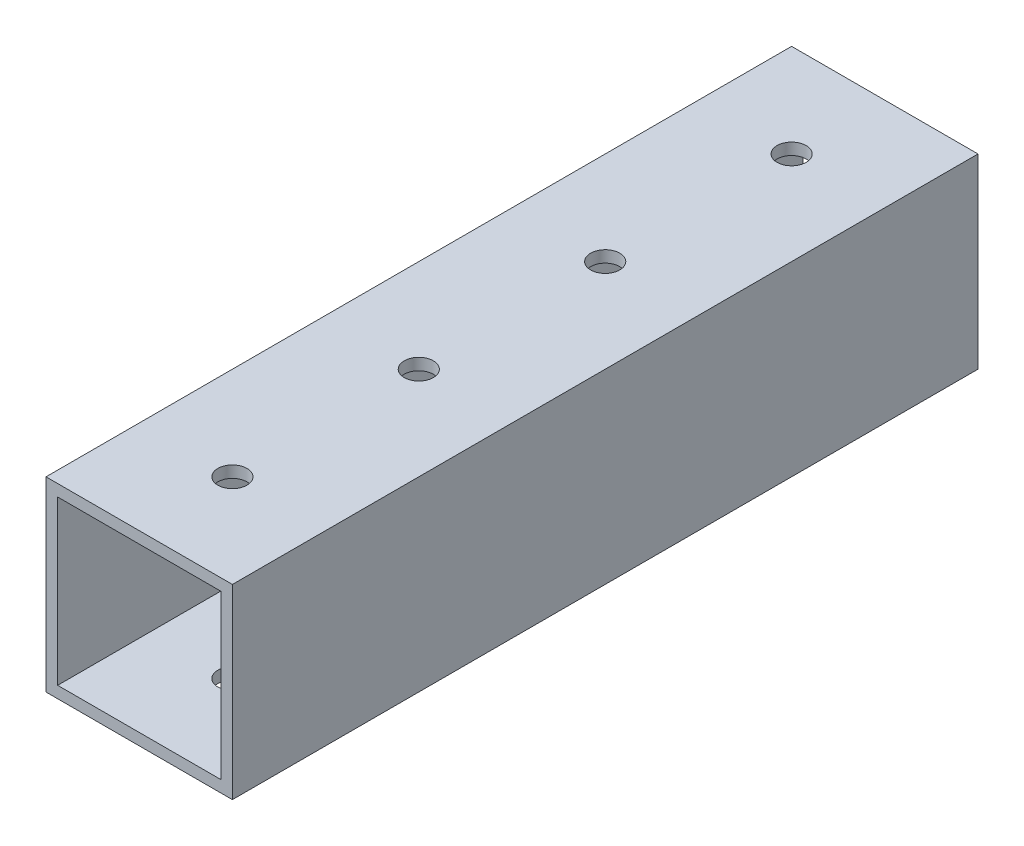
ISO-10303-21;
HEADER;
FILE_DESCRIPTION(('STEP AP214'),'2;1');
FILE_NAME('part.step','',(''),(''),'','','');
FILE_SCHEMA(('AUTOMOTIVE_DESIGN { 1 0 10303 214 1 1 1 1 }'));
ENDSEC;
DATA;
#1=APPLICATION_CONTEXT('core data for automotive mechanical design processes');
#2=APPLICATION_PROTOCOL_DEFINITION('international standard','automotive_design',2000,#1);
#3=PRODUCT_CONTEXT('',#1,'mechanical');
#4=PRODUCT('Part','Part','',(#3));
#5=PRODUCT_RELATED_PRODUCT_CATEGORY('part','',(#4));
#6=PRODUCT_DEFINITION_FORMATION('','',#4);
#7=PRODUCT_DEFINITION_CONTEXT('part definition',#1,'design');
#8=PRODUCT_DEFINITION('design','',#6,#7);
#9=PRODUCT_DEFINITION_SHAPE('','',#8);
#10=(LENGTH_UNIT() NAMED_UNIT(*) SI_UNIT(.MILLI.,.METRE.));
#11=(NAMED_UNIT(*) PLANE_ANGLE_UNIT() SI_UNIT($,.RADIAN.));
#12=(NAMED_UNIT(*) SI_UNIT($,.STERADIAN.) SOLID_ANGLE_UNIT());
#13=UNCERTAINTY_MEASURE_WITH_UNIT(LENGTH_MEASURE(1.E-05),#10,'distance_accuracy_value','');
#14=(GEOMETRIC_REPRESENTATION_CONTEXT(3) GLOBAL_UNCERTAINTY_ASSIGNED_CONTEXT((#13)) GLOBAL_UNIT_ASSIGNED_CONTEXT((#10,
#11,#12)) REPRESENTATION_CONTEXT('',''));
#15=CARTESIAN_POINT('',(0.,0.,0.));
#16=DIRECTION('',(0.,0.,1.));
#17=DIRECTION('',(1.,0.,0.));
#18=AXIS2_PLACEMENT_3D('',#15,#16,#17);
#19=CARTESIAN_POINT('',(0.,0.,101.6));
#20=DIRECTION('',(0.,0.,1.));
#21=DIRECTION('',(1.,0.,0.));
#22=AXIS2_PLACEMENT_3D('',#19,#20,#21);
#23=PLANE('',#22);
#24=DIRECTION('',(0.,1.,0.));
#25=VECTOR('',#24,1.);
#26=CARTESIAN_POINT('',(12.7,12.7,101.6));
#27=LINE('',#26,#25);
#28=CARTESIAN_POINT('',(12.7,-12.7,101.6));
#29=VERTEX_POINT('',#28);
#30=CARTESIAN_POINT('',(12.7,12.7,101.6));
#31=VERTEX_POINT('',#30);
#32=EDGE_CURVE('E138',#29,#31,#27,.T.);
#33=ORIENTED_EDGE('',*,*,#32,.T.);
#34=DIRECTION('',(-1.,0.,0.));
#35=VECTOR('',#34,1.);
#36=CARTESIAN_POINT('',(-12.7,12.7,101.6));
#37=LINE('',#36,#35);
#38=CARTESIAN_POINT('',(-12.7,12.7,101.6));
#39=VERTEX_POINT('',#38);
#40=EDGE_CURVE('E141',#31,#39,#37,.T.);
#41=ORIENTED_EDGE('',*,*,#40,.T.);
#42=DIRECTION('',(0.,-1.,0.));
#43=VECTOR('',#42,1.);
#44=CARTESIAN_POINT('',(-12.7,12.7,101.6));
#45=LINE('',#44,#43);
#46=CARTESIAN_POINT('',(-12.7,-12.7,101.6));
#47=VERTEX_POINT('',#46);
#48=EDGE_CURVE('E144',#39,#47,#45,.T.);
#49=ORIENTED_EDGE('',*,*,#48,.T.);
#50=DIRECTION('',(1.,0.,0.));
#51=VECTOR('',#50,1.);
#52=CARTESIAN_POINT('',(-12.7,-12.7,101.6));
#53=LINE('',#52,#51);
#54=EDGE_CURVE('E146',#47,#29,#53,.T.);
#55=ORIENTED_EDGE('',*,*,#54,.T.);
#56=EDGE_LOOP('',(#33,#41,#49,#55));
#57=FACE_BOUND('',#56,.T.);
#58=DIRECTION('',(-1.,0.,0.));
#59=VECTOR('',#58,1.);
#60=CARTESIAN_POINT('',(-11.1125,11.1125,101.6));
#61=LINE('',#60,#59);
#62=CARTESIAN_POINT('',(11.1125,11.1125,101.6));
#63=VERTEX_POINT('',#62);
#64=CARTESIAN_POINT('',(-11.1125,11.1125,101.6));
#65=VERTEX_POINT('',#64);
#66=EDGE_CURVE('E108',#63,#65,#61,.T.);
#67=ORIENTED_EDGE('',*,*,#66,.F.);
#68=DIRECTION('',(0.,1.,0.));
#69=VECTOR('',#68,1.);
#70=CARTESIAN_POINT('',(11.1125,11.1125,101.6));
#71=LINE('',#70,#69);
#72=CARTESIAN_POINT('',(11.1125,-11.1125,101.6));
#73=VERTEX_POINT('',#72);
#74=EDGE_CURVE('E100',#73,#63,#71,.T.);
#75=ORIENTED_EDGE('',*,*,#74,.F.);
#76=DIRECTION('',(1.,0.,0.));
#77=VECTOR('',#76,1.);
#78=CARTESIAN_POINT('',(-11.1125,-11.1125,101.6));
#79=LINE('',#78,#77);
#80=CARTESIAN_POINT('',(-11.1125,-11.1125,101.6));
#81=VERTEX_POINT('',#80);
#82=EDGE_CURVE('E122',#81,#73,#79,.T.);
#83=ORIENTED_EDGE('',*,*,#82,.F.);
#84=DIRECTION('',(0.,-1.,0.));
#85=VECTOR('',#84,1.);
#86=CARTESIAN_POINT('',(-11.1125,11.1125,101.6));
#87=LINE('',#86,#85);
#88=EDGE_CURVE('E120',#65,#81,#87,.T.);
#89=ORIENTED_EDGE('',*,*,#88,.F.);
#90=EDGE_LOOP('',(#67,#75,#83,#89));
#91=FACE_BOUND('',#90,.T.);
#92=ADVANCED_FACE('F33',(#57,#91),#23,.T.);
#93=CARTESIAN_POINT('',(0.,0.,0.));
#94=DIRECTION('',(0.,0.,1.));
#95=DIRECTION('',(1.,0.,0.));
#96=AXIS2_PLACEMENT_3D('',#93,#94,#95);
#97=PLANE('',#96);
#98=DIRECTION('',(0.,1.,0.));
#99=VECTOR('',#98,1.);
#100=CARTESIAN_POINT('',(12.7,12.7,0.));
#101=LINE('',#100,#99);
#102=CARTESIAN_POINT('',(12.7,-12.7,0.));
#103=VERTEX_POINT('',#102);
#104=CARTESIAN_POINT('',(12.7,12.7,0.));
#105=VERTEX_POINT('',#104);
#106=EDGE_CURVE('E116',#103,#105,#101,.T.);
#107=ORIENTED_EDGE('',*,*,#106,.F.);
#108=DIRECTION('',(1.,0.,0.));
#109=VECTOR('',#108,1.);
#110=CARTESIAN_POINT('',(-12.7,-12.7,0.));
#111=LINE('',#110,#109);
#112=CARTESIAN_POINT('',(-12.7,-12.7,0.));
#113=VERTEX_POINT('',#112);
#114=EDGE_CURVE('E142',#113,#103,#111,.T.);
#115=ORIENTED_EDGE('',*,*,#114,.F.);
#116=DIRECTION('',(0.,-1.,0.));
#117=VECTOR('',#116,1.);
#118=CARTESIAN_POINT('',(-12.7,12.7,0.));
#119=LINE('',#118,#117);
#120=CARTESIAN_POINT('',(-12.7,12.7,0.));
#121=VERTEX_POINT('',#120);
#122=EDGE_CURVE('E153',#121,#113,#119,.T.);
#123=ORIENTED_EDGE('',*,*,#122,.F.);
#124=DIRECTION('',(-1.,0.,0.));
#125=VECTOR('',#124,1.);
#126=CARTESIAN_POINT('',(-12.7,12.7,0.));
#127=LINE('',#126,#125);
#128=EDGE_CURVE('E151',#105,#121,#127,.T.);
#129=ORIENTED_EDGE('',*,*,#128,.F.);
#130=EDGE_LOOP('',(#107,#115,#123,#129));
#131=FACE_BOUND('',#130,.T.);
#132=DIRECTION('',(0.,1.,0.));
#133=VECTOR('',#132,1.);
#134=CARTESIAN_POINT('',(11.1125,11.1125,0.));
#135=LINE('',#134,#133);
#136=CARTESIAN_POINT('',(11.1125,-11.1125,0.));
#137=VERTEX_POINT('',#136);
#138=CARTESIAN_POINT('',(11.1125,11.1125,0.));
#139=VERTEX_POINT('',#138);
#140=EDGE_CURVE('E58',#137,#139,#135,.T.);
#141=ORIENTED_EDGE('',*,*,#140,.T.);
#142=DIRECTION('',(-1.,0.,0.));
#143=VECTOR('',#142,1.);
#144=CARTESIAN_POINT('',(-11.1125,11.1125,0.));
#145=LINE('',#144,#143);
#146=CARTESIAN_POINT('',(-11.1125,11.1125,0.));
#147=VERTEX_POINT('',#146);
#148=EDGE_CURVE('E115',#139,#147,#145,.T.);
#149=ORIENTED_EDGE('',*,*,#148,.T.);
#150=DIRECTION('',(0.,-1.,0.));
#151=VECTOR('',#150,1.);
#152=CARTESIAN_POINT('',(-11.1125,11.1125,0.));
#153=LINE('',#152,#151);
#154=CARTESIAN_POINT('',(-11.1125,-11.1125,0.));
#155=VERTEX_POINT('',#154);
#156=EDGE_CURVE('E130',#147,#155,#153,.T.);
#157=ORIENTED_EDGE('',*,*,#156,.T.);
#158=DIRECTION('',(1.,0.,0.));
#159=VECTOR('',#158,1.);
#160=CARTESIAN_POINT('',(-11.1125,-11.1125,0.));
#161=LINE('',#160,#159);
#162=EDGE_CURVE('E109',#155,#137,#161,.T.);
#163=ORIENTED_EDGE('',*,*,#162,.T.);
#164=EDGE_LOOP('',(#141,#149,#157,#163));
#165=FACE_BOUND('',#164,.T.);
#166=ADVANCED_FACE('F223',(#131,#165),#97,.F.);
#167=CARTESIAN_POINT('',(12.7,12.7,101.6));
#168=DIRECTION('',(-1.,0.,0.));
#169=DIRECTION('',(0.,-1.,0.));
#170=AXIS2_PLACEMENT_3D('',#167,#168,#169);
#171=PLANE('',#170);
#172=ORIENTED_EDGE('',*,*,#106,.T.);
#173=DIRECTION('',(0.,0.,-1.));
#174=VECTOR('',#173,1.);
#175=CARTESIAN_POINT('',(12.7,12.7,101.6));
#176=LINE('',#175,#174);
#177=EDGE_CURVE('E11',#31,#105,#176,.T.);
#178=ORIENTED_EDGE('',*,*,#177,.F.);
#179=ORIENTED_EDGE('',*,*,#32,.F.);
#180=DIRECTION('',(0.,0.,-1.));
#181=VECTOR('',#180,1.);
#182=CARTESIAN_POINT('',(12.7,-12.7,101.6));
#183=LINE('',#182,#181);
#184=EDGE_CURVE('E148',#29,#103,#183,.T.);
#185=ORIENTED_EDGE('',*,*,#184,.T.);
#186=EDGE_LOOP('',(#172,#178,#179,#185));
#187=FACE_BOUND('',#186,.T.);
#188=ADVANCED_FACE('F35',(#187),#171,.F.);
#189=CARTESIAN_POINT('',(-12.7,12.7,101.6));
#190=DIRECTION('',(0.,-1.,0.));
#191=DIRECTION('',(0.,0.,-1.));
#192=AXIS2_PLACEMENT_3D('',#189,#190,#191);
#193=PLANE('',#192);
#194=CARTESIAN_POINT('',(-2.66050878019846E-13,12.7,12.7));
#195=DIRECTION('',(0.,1.,0.));
#196=DIRECTION('',(0.,0.,1.));
#197=AXIS2_PLACEMENT_3D('',#194,#195,#196);
#198=CIRCLE('',#197,1.98437499999999);
#199=CARTESIAN_POINT('',(-2.66050878019846E-13,12.7,14.684375));
#200=VERTEX_POINT('',#199);
#201=EDGE_CURVE('E248',#200,#200,#198,.T.);
#202=ORIENTED_EDGE('',*,*,#201,.F.);
#203=EDGE_LOOP('',(#202));
#204=FACE_BOUND('',#203,.T.);
#205=CARTESIAN_POINT('',(-1.77367252013231E-13,12.7,38.1));
#206=DIRECTION('',(0.,1.,0.));
#207=DIRECTION('',(0.,0.,1.));
#208=AXIS2_PLACEMENT_3D('',#205,#206,#207);
#209=CIRCLE('',#208,1.98437499999999);
#210=CARTESIAN_POINT('',(-1.77367252013231E-13,12.7,40.084375));
#211=VERTEX_POINT('',#210);
#212=EDGE_CURVE('E181',#211,#211,#209,.T.);
#213=ORIENTED_EDGE('',*,*,#212,.F.);
#214=EDGE_LOOP('',(#213));
#215=FACE_BOUND('',#214,.T.);
#216=CARTESIAN_POINT('',(0.,12.7,63.5));
#217=DIRECTION('',(0.,1.,0.));
#218=DIRECTION('',(0.,0.,1.));
#219=AXIS2_PLACEMENT_3D('',#216,#217,#218);
#220=CIRCLE('',#219,1.98437499999999);
#221=CARTESIAN_POINT('',(0.,12.7,65.484375));
#222=VERTEX_POINT('',#221);
#223=EDGE_CURVE('E178',#222,#222,#220,.T.);
#224=ORIENTED_EDGE('',*,*,#223,.F.);
#225=EDGE_LOOP('',(#224));
#226=FACE_BOUND('',#225,.T.);
#227=CARTESIAN_POINT('',(0.,12.7,88.9));
#228=DIRECTION('',(0.,1.,0.));
#229=DIRECTION('',(0.,0.,1.));
#230=AXIS2_PLACEMENT_3D('',#227,#228,#229);
#231=CIRCLE('',#230,1.98437499999999);
#232=CARTESIAN_POINT('',(0.,12.7,90.884375));
#233=VERTEX_POINT('',#232);
#234=EDGE_CURVE('E197',#233,#233,#231,.T.);
#235=ORIENTED_EDGE('',*,*,#234,.F.);
#236=EDGE_LOOP('',(#235));
#237=FACE_BOUND('',#236,.T.);
#238=ORIENTED_EDGE('',*,*,#128,.T.);
#239=DIRECTION('',(0.,0.,-1.));
#240=VECTOR('',#239,1.);
#241=CARTESIAN_POINT('',(-12.7,12.7,101.6));
#242=LINE('',#241,#240);
#243=EDGE_CURVE('E42',#39,#121,#242,.T.);
#244=ORIENTED_EDGE('',*,*,#243,.F.);
#245=ORIENTED_EDGE('',*,*,#40,.F.);
#246=ORIENTED_EDGE('',*,*,#177,.T.);
#247=EDGE_LOOP('',(#238,#244,#245,#246));
#248=FACE_BOUND('',#247,.T.);
#249=ADVANCED_FACE('F237',(#204,#215,#226,#237,#248),#193,.F.);
#250=CARTESIAN_POINT('',(-12.7,12.7,101.6));
#251=DIRECTION('',(1.,0.,0.));
#252=DIRECTION('',(0.,1.,0.));
#253=AXIS2_PLACEMENT_3D('',#250,#251,#252);
#254=PLANE('',#253);
#255=ORIENTED_EDGE('',*,*,#122,.T.);
#256=DIRECTION('',(0.,0.,-1.));
#257=VECTOR('',#256,1.);
#258=CARTESIAN_POINT('',(-12.7,-12.7,101.6));
#259=LINE('',#258,#257);
#260=EDGE_CURVE('E158',#47,#113,#259,.T.);
#261=ORIENTED_EDGE('',*,*,#260,.F.);
#262=ORIENTED_EDGE('',*,*,#48,.F.);
#263=ORIENTED_EDGE('',*,*,#243,.T.);
#264=EDGE_LOOP('',(#255,#261,#262,#263));
#265=FACE_BOUND('',#264,.T.);
#266=ADVANCED_FACE('F234',(#265),#254,.F.);
#267=CARTESIAN_POINT('',(-12.7,-12.7,101.6));
#268=DIRECTION('',(0.,1.,0.));
#269=DIRECTION('',(0.,0.,1.));
#270=AXIS2_PLACEMENT_3D('',#267,#268,#269);
#271=PLANE('',#270);
#272=CARTESIAN_POINT('',(-2.66050878019846E-13,-12.7,12.7));
#273=DIRECTION('',(0.,1.,0.));
#274=DIRECTION('',(0.,0.,1.));
#275=AXIS2_PLACEMENT_3D('',#272,#273,#274);
#276=CIRCLE('',#275,1.98437499999999);
#277=CARTESIAN_POINT('',(-2.66050878019846E-13,-12.7,14.684375));
#278=VERTEX_POINT('',#277);
#279=EDGE_CURVE('E303',#278,#278,#276,.T.);
#280=ORIENTED_EDGE('',*,*,#279,.T.);
#281=EDGE_LOOP('',(#280));
#282=FACE_BOUND('',#281,.T.);
#283=CARTESIAN_POINT('',(-1.77367252013231E-13,-12.7,38.1));
#284=DIRECTION('',(0.,1.,0.));
#285=DIRECTION('',(0.,0.,1.));
#286=AXIS2_PLACEMENT_3D('',#283,#284,#285);
#287=CIRCLE('',#286,1.98437499999999);
#288=CARTESIAN_POINT('',(-1.77367252013231E-13,-12.7,40.084375));
#289=VERTEX_POINT('',#288);
#290=EDGE_CURVE('E174',#289,#289,#287,.T.);
#291=ORIENTED_EDGE('',*,*,#290,.T.);
#292=EDGE_LOOP('',(#291));
#293=FACE_BOUND('',#292,.T.);
#294=CARTESIAN_POINT('',(0.,-12.7,63.5));
#295=DIRECTION('',(0.,1.,0.));
#296=DIRECTION('',(0.,0.,1.));
#297=AXIS2_PLACEMENT_3D('',#294,#295,#296);
#298=CIRCLE('',#297,1.98437499999999);
#299=CARTESIAN_POINT('',(0.,-12.7,65.484375));
#300=VERTEX_POINT('',#299);
#301=EDGE_CURVE('E170',#300,#300,#298,.T.);
#302=ORIENTED_EDGE('',*,*,#301,.T.);
#303=EDGE_LOOP('',(#302));
#304=FACE_BOUND('',#303,.T.);
#305=CARTESIAN_POINT('',(0.,-12.7,88.9));
#306=DIRECTION('',(0.,1.,0.));
#307=DIRECTION('',(0.,0.,1.));
#308=AXIS2_PLACEMENT_3D('',#305,#306,#307);
#309=CIRCLE('',#308,1.98437499999999);
#310=CARTESIAN_POINT('',(0.,-12.7,90.884375));
#311=VERTEX_POINT('',#310);
#312=EDGE_CURVE('E166',#311,#311,#309,.T.);
#313=ORIENTED_EDGE('',*,*,#312,.T.);
#314=EDGE_LOOP('',(#313));
#315=FACE_BOUND('',#314,.T.);
#316=ORIENTED_EDGE('',*,*,#114,.T.);
#317=ORIENTED_EDGE('',*,*,#184,.F.);
#318=ORIENTED_EDGE('',*,*,#54,.F.);
#319=ORIENTED_EDGE('',*,*,#260,.T.);
#320=EDGE_LOOP('',(#316,#317,#318,#319));
#321=FACE_BOUND('',#320,.T.);
#322=ADVANCED_FACE('F218',(#282,#293,#304,#315,#321),#271,.F.);
#323=CARTESIAN_POINT('',(11.1125,11.1125,101.6));
#324=DIRECTION('',(-1.,0.,0.));
#325=DIRECTION('',(0.,0.,1.));
#326=AXIS2_PLACEMENT_3D('',#323,#324,#325);
#327=PLANE('',#326);
#328=ORIENTED_EDGE('',*,*,#140,.F.);
#329=DIRECTION('',(0.,0.,-1.));
#330=VECTOR('',#329,1.);
#331=CARTESIAN_POINT('',(11.1125,-11.1125,101.6));
#332=LINE('',#331,#330);
#333=EDGE_CURVE('E104',#73,#137,#332,.T.);
#334=ORIENTED_EDGE('',*,*,#333,.F.);
#335=ORIENTED_EDGE('',*,*,#74,.T.);
#336=DIRECTION('',(0.,0.,-1.));
#337=VECTOR('',#336,1.);
#338=CARTESIAN_POINT('',(11.1125,11.1125,101.6));
#339=LINE('',#338,#337);
#340=EDGE_CURVE('E103',#63,#139,#339,.T.);
#341=ORIENTED_EDGE('',*,*,#340,.T.);
#342=EDGE_LOOP('',(#328,#334,#335,#341));
#343=FACE_BOUND('',#342,.T.);
#344=ADVANCED_FACE('F102',(#343),#327,.T.);
#345=CARTESIAN_POINT('',(-11.1125,11.1125,101.6));
#346=DIRECTION('',(0.,-1.,0.));
#347=DIRECTION('',(0.,0.,-1.));
#348=AXIS2_PLACEMENT_3D('',#345,#346,#347);
#349=PLANE('',#348);
#350=CARTESIAN_POINT('',(-2.66050878019846E-13,11.1125,12.7));
#351=DIRECTION('',(0.,-1.,0.));
#352=DIRECTION('',(0.,0.,-1.));
#353=AXIS2_PLACEMENT_3D('',#350,#351,#352);
#354=CIRCLE('',#353,1.98437499999999);
#355=CARTESIAN_POINT('',(-2.66050878019846E-13,11.1125,10.715625));
#356=VERTEX_POINT('',#355);
#357=EDGE_CURVE('E186',#356,#356,#354,.T.);
#358=ORIENTED_EDGE('',*,*,#357,.F.);
#359=EDGE_LOOP('',(#358));
#360=FACE_BOUND('',#359,.T.);
#361=CARTESIAN_POINT('',(-1.77367252013231E-13,11.1125,38.1));
#362=DIRECTION('',(0.,-1.,0.));
#363=DIRECTION('',(0.,0.,-1.));
#364=AXIS2_PLACEMENT_3D('',#361,#362,#363);
#365=CIRCLE('',#364,1.98437499999999);
#366=CARTESIAN_POINT('',(-1.77367252013231E-13,11.1125,36.115625));
#367=VERTEX_POINT('',#366);
#368=EDGE_CURVE('E173',#367,#367,#365,.T.);
#369=ORIENTED_EDGE('',*,*,#368,.F.);
#370=EDGE_LOOP('',(#369));
#371=FACE_BOUND('',#370,.T.);
#372=CARTESIAN_POINT('',(0.,11.1125,63.5));
#373=DIRECTION('',(0.,-1.,0.));
#374=DIRECTION('',(0.,0.,-1.));
#375=AXIS2_PLACEMENT_3D('',#372,#373,#374);
#376=CIRCLE('',#375,1.98437499999999);
#377=CARTESIAN_POINT('',(0.,11.1125,61.515625));
#378=VERTEX_POINT('',#377);
#379=EDGE_CURVE('E169',#378,#378,#376,.T.);
#380=ORIENTED_EDGE('',*,*,#379,.F.);
#381=EDGE_LOOP('',(#380));
#382=FACE_BOUND('',#381,.T.);
#383=CARTESIAN_POINT('',(0.,11.1125,88.9));
#384=DIRECTION('',(0.,-1.,0.));
#385=DIRECTION('',(0.,0.,-1.));
#386=AXIS2_PLACEMENT_3D('',#383,#384,#385);
#387=CIRCLE('',#386,1.98437499999999);
#388=CARTESIAN_POINT('',(0.,11.1125,86.915625));
#389=VERTEX_POINT('',#388);
#390=EDGE_CURVE('E128',#389,#389,#387,.T.);
#391=ORIENTED_EDGE('',*,*,#390,.F.);
#392=EDGE_LOOP('',(#391));
#393=FACE_BOUND('',#392,.T.);
#394=ORIENTED_EDGE('',*,*,#148,.F.);
#395=ORIENTED_EDGE('',*,*,#340,.F.);
#396=ORIENTED_EDGE('',*,*,#66,.T.);
#397=DIRECTION('',(0.,0.,-1.));
#398=VECTOR('',#397,1.);
#399=CARTESIAN_POINT('',(-11.1125,11.1125,101.6));
#400=LINE('',#399,#398);
#401=EDGE_CURVE('E117',#65,#147,#400,.T.);
#402=ORIENTED_EDGE('',*,*,#401,.T.);
#403=EDGE_LOOP('',(#394,#395,#396,#402));
#404=FACE_BOUND('',#403,.T.);
#405=ADVANCED_FACE('F112',(#360,#371,#382,#393,#404),#349,.T.);
#406=CARTESIAN_POINT('',(-11.1125,11.1125,101.6));
#407=DIRECTION('',(1.,0.,0.));
#408=DIRECTION('',(0.,1.,0.));
#409=AXIS2_PLACEMENT_3D('',#406,#407,#408);
#410=PLANE('',#409);
#411=ORIENTED_EDGE('',*,*,#156,.F.);
#412=ORIENTED_EDGE('',*,*,#401,.F.);
#413=ORIENTED_EDGE('',*,*,#88,.T.);
#414=DIRECTION('',(0.,0.,-1.));
#415=VECTOR('',#414,1.);
#416=CARTESIAN_POINT('',(-11.1125,-11.1125,101.6));
#417=LINE('',#416,#415);
#418=EDGE_CURVE('E50',#81,#155,#417,.T.);
#419=ORIENTED_EDGE('',*,*,#418,.T.);
#420=EDGE_LOOP('',(#411,#412,#413,#419));
#421=FACE_BOUND('',#420,.T.);
#422=ADVANCED_FACE('F208',(#421),#410,.T.);
#423=CARTESIAN_POINT('',(-11.1125,-11.1125,101.6));
#424=DIRECTION('',(0.,1.,0.));
#425=DIRECTION('',(0.,0.,1.));
#426=AXIS2_PLACEMENT_3D('',#423,#424,#425);
#427=PLANE('',#426);
#428=CARTESIAN_POINT('',(-2.66050878019846E-13,-11.1125,12.7));
#429=DIRECTION('',(0.,1.,0.));
#430=DIRECTION('',(0.,0.,1.));
#431=AXIS2_PLACEMENT_3D('',#428,#429,#430);
#432=CIRCLE('',#431,1.98437499999999);
#433=CARTESIAN_POINT('',(-2.66050878019846E-13,-11.1125,14.684375));
#434=VERTEX_POINT('',#433);
#435=EDGE_CURVE('E37',#434,#434,#432,.T.);
#436=ORIENTED_EDGE('',*,*,#435,.F.);
#437=EDGE_LOOP('',(#436));
#438=FACE_BOUND('',#437,.T.);
#439=CARTESIAN_POINT('',(-1.77367252013231E-13,-11.1125,38.1));
#440=DIRECTION('',(0.,1.,0.));
#441=DIRECTION('',(0.,0.,1.));
#442=AXIS2_PLACEMENT_3D('',#439,#440,#441);
#443=CIRCLE('',#442,1.98437499999999);
#444=CARTESIAN_POINT('',(-1.77367252013231E-13,-11.1125,40.084375));
#445=VERTEX_POINT('',#444);
#446=EDGE_CURVE('E171',#445,#445,#443,.T.);
#447=ORIENTED_EDGE('',*,*,#446,.F.);
#448=EDGE_LOOP('',(#447));
#449=FACE_BOUND('',#448,.T.);
#450=CARTESIAN_POINT('',(0.,-11.1125,63.5));
#451=DIRECTION('',(0.,1.,0.));
#452=DIRECTION('',(0.,0.,1.));
#453=AXIS2_PLACEMENT_3D('',#450,#451,#452);
#454=CIRCLE('',#453,1.98437499999999);
#455=CARTESIAN_POINT('',(0.,-11.1125,65.484375));
#456=VERTEX_POINT('',#455);
#457=EDGE_CURVE('E167',#456,#456,#454,.T.);
#458=ORIENTED_EDGE('',*,*,#457,.F.);
#459=EDGE_LOOP('',(#458));
#460=FACE_BOUND('',#459,.T.);
#461=CARTESIAN_POINT('',(0.,-11.1125,88.9));
#462=DIRECTION('',(0.,1.,0.));
#463=DIRECTION('',(0.,0.,1.));
#464=AXIS2_PLACEMENT_3D('',#461,#462,#463);
#465=CIRCLE('',#464,1.98437499999999);
#466=CARTESIAN_POINT('',(0.,-11.1125,90.884375));
#467=VERTEX_POINT('',#466);
#468=EDGE_CURVE('E163',#467,#467,#465,.T.);
#469=ORIENTED_EDGE('',*,*,#468,.F.);
#470=EDGE_LOOP('',(#469));
#471=FACE_BOUND('',#470,.T.);
#472=ORIENTED_EDGE('',*,*,#162,.F.);
#473=ORIENTED_EDGE('',*,*,#418,.F.);
#474=ORIENTED_EDGE('',*,*,#82,.T.);
#475=ORIENTED_EDGE('',*,*,#333,.T.);
#476=EDGE_LOOP('',(#472,#473,#474,#475));
#477=FACE_BOUND('',#476,.T.);
#478=ADVANCED_FACE('F215',(#438,#449,#460,#471,#477),#427,.T.);
#479=CARTESIAN_POINT('',(0.,-12.7,88.9));
#480=DIRECTION('',(0.,1.,0.));
#481=DIRECTION('',(0.,0.,1.));
#482=AXIS2_PLACEMENT_3D('',#479,#480,#481);
#483=CYLINDRICAL_SURFACE('',#482,1.98437499999999);
#484=ORIENTED_EDGE('',*,*,#468,.T.);
#485=EDGE_LOOP('',(#484));
#486=FACE_BOUND('',#485,.T.);
#487=ORIENTED_EDGE('',*,*,#312,.F.);
#488=EDGE_LOOP('',(#487));
#489=FACE_BOUND('',#488,.T.);
#490=ADVANCED_FACE('F269',(#486,#489),#483,.F.);
#491=ORIENTED_EDGE('',*,*,#390,.T.);
#492=EDGE_LOOP('',(#491));
#493=FACE_BOUND('',#492,.T.);
#494=ORIENTED_EDGE('',*,*,#234,.T.);
#495=EDGE_LOOP('',(#494));
#496=FACE_BOUND('',#495,.T.);
#497=ADVANCED_FACE('F204',(#493,#496),#483,.F.);
#498=CARTESIAN_POINT('',(0.,-12.7,63.5));
#499=DIRECTION('',(0.,1.,0.));
#500=DIRECTION('',(0.,0.,1.));
#501=AXIS2_PLACEMENT_3D('',#498,#499,#500);
#502=CYLINDRICAL_SURFACE('',#501,1.98437499999999);
#503=ORIENTED_EDGE('',*,*,#457,.T.);
#504=EDGE_LOOP('',(#503));
#505=FACE_BOUND('',#504,.T.);
#506=ORIENTED_EDGE('',*,*,#301,.F.);
#507=EDGE_LOOP('',(#506));
#508=FACE_BOUND('',#507,.T.);
#509=ADVANCED_FACE('F280',(#505,#508),#502,.F.);
#510=ORIENTED_EDGE('',*,*,#379,.T.);
#511=EDGE_LOOP('',(#510));
#512=FACE_BOUND('',#511,.T.);
#513=ORIENTED_EDGE('',*,*,#223,.T.);
#514=EDGE_LOOP('',(#513));
#515=FACE_BOUND('',#514,.T.);
#516=ADVANCED_FACE('F283',(#512,#515),#502,.F.);
#517=CARTESIAN_POINT('',(-1.77367252013231E-13,-12.7,38.1));
#518=DIRECTION('',(0.,1.,0.));
#519=DIRECTION('',(0.,0.,1.));
#520=AXIS2_PLACEMENT_3D('',#517,#518,#519);
#521=CYLINDRICAL_SURFACE('',#520,1.98437499999999);
#522=ORIENTED_EDGE('',*,*,#446,.T.);
#523=EDGE_LOOP('',(#522));
#524=FACE_BOUND('',#523,.T.);
#525=ORIENTED_EDGE('',*,*,#290,.F.);
#526=EDGE_LOOP('',(#525));
#527=FACE_BOUND('',#526,.T.);
#528=ADVANCED_FACE('F285',(#524,#527),#521,.F.);
#529=ORIENTED_EDGE('',*,*,#368,.T.);
#530=EDGE_LOOP('',(#529));
#531=FACE_BOUND('',#530,.T.);
#532=ORIENTED_EDGE('',*,*,#212,.T.);
#533=EDGE_LOOP('',(#532));
#534=FACE_BOUND('',#533,.T.);
#535=ADVANCED_FACE('F288',(#531,#534),#521,.F.);
#536=CARTESIAN_POINT('',(-2.66050878019846E-13,-12.7,12.7));
#537=DIRECTION('',(0.,1.,0.));
#538=DIRECTION('',(0.,0.,1.));
#539=AXIS2_PLACEMENT_3D('',#536,#537,#538);
#540=CYLINDRICAL_SURFACE('',#539,1.98437499999999);
#541=ORIENTED_EDGE('',*,*,#435,.T.);
#542=EDGE_LOOP('',(#541));
#543=FACE_BOUND('',#542,.T.);
#544=ORIENTED_EDGE('',*,*,#279,.F.);
#545=EDGE_LOOP('',(#544));
#546=FACE_BOUND('',#545,.T.);
#547=ADVANCED_FACE('F289',(#543,#546),#540,.F.);
#548=ORIENTED_EDGE('',*,*,#357,.T.);
#549=EDGE_LOOP('',(#548));
#550=FACE_BOUND('',#549,.T.);
#551=ORIENTED_EDGE('',*,*,#201,.T.);
#552=EDGE_LOOP('',(#551));
#553=FACE_BOUND('',#552,.T.);
#554=ADVANCED_FACE('F291',(#550,#553),#540,.F.);
#555=CLOSED_SHELL('',(#92,#166,#188,#249,#266,#322,#344,#405,#422,#478,#490,#497,#509,#516,#528,
#535,#547,#554));
#556=MANIFOLD_SOLID_BREP('B2',#555);
#557=ADVANCED_BREP_SHAPE_REPRESENTATION('',(#18,#556),#14);
#558=SHAPE_DEFINITION_REPRESENTATION(#9,#557);
ENDSEC;
END-ISO-10303-21;
